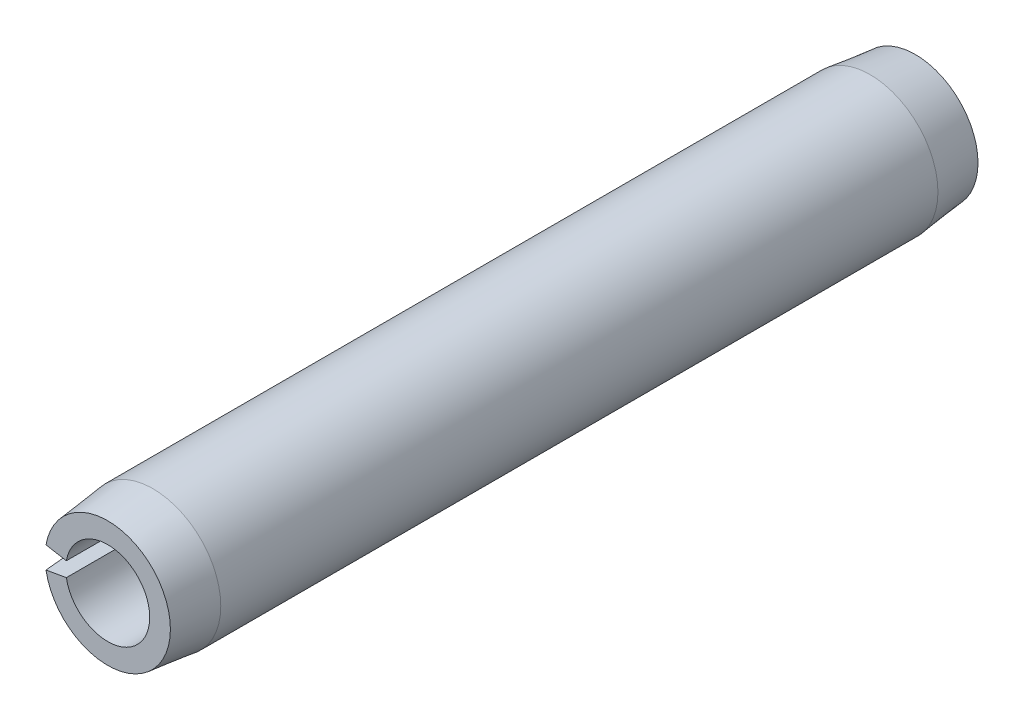
ISO-10303-21;
HEADER;
FILE_DESCRIPTION(('STEP AP214'),'2;1');
FILE_NAME('part.step','',(''),(''),'','','');
FILE_SCHEMA(('AUTOMOTIVE_DESIGN { 1 0 10303 214 1 1 1 1 }'));
ENDSEC;
DATA;
#1=APPLICATION_CONTEXT('core data for automotive mechanical design processes');
#2=APPLICATION_PROTOCOL_DEFINITION('international standard','automotive_design',2000,#1);
#3=PRODUCT_CONTEXT('',#1,'mechanical');
#4=PRODUCT('Part','Part','',(#3));
#5=PRODUCT_RELATED_PRODUCT_CATEGORY('part','',(#4));
#6=PRODUCT_DEFINITION_FORMATION('','',#4);
#7=PRODUCT_DEFINITION_CONTEXT('part definition',#1,'design');
#8=PRODUCT_DEFINITION('design','',#6,#7);
#9=PRODUCT_DEFINITION_SHAPE('','',#8);
#10=(LENGTH_UNIT() NAMED_UNIT(*) SI_UNIT(.MILLI.,.METRE.));
#11=(NAMED_UNIT(*) PLANE_ANGLE_UNIT() SI_UNIT($,.RADIAN.));
#12=(NAMED_UNIT(*) SI_UNIT($,.STERADIAN.) SOLID_ANGLE_UNIT());
#13=UNCERTAINTY_MEASURE_WITH_UNIT(LENGTH_MEASURE(1.E-05),#10,'distance_accuracy_value','');
#14=(GEOMETRIC_REPRESENTATION_CONTEXT(3) GLOBAL_UNCERTAINTY_ASSIGNED_CONTEXT((#13)) GLOBAL_UNIT_ASSIGNED_CONTEXT((#10,
#11,#12)) REPRESENTATION_CONTEXT('',''));
#15=CARTESIAN_POINT('',(0.,0.,0.));
#16=DIRECTION('',(0.,0.,1.));
#17=DIRECTION('',(1.,0.,0.));
#18=AXIS2_PLACEMENT_3D('',#15,#16,#17);
#19=CARTESIAN_POINT('',(0.,0.,4.7625));
#20=DIRECTION('',(0.,0.,1.));
#21=DIRECTION('',(1.,0.,0.));
#22=AXIS2_PLACEMENT_3D('',#19,#20,#21);
#23=PLANE('',#22);
#24=CARTESIAN_POINT('',(0.,0.,4.7625));
#25=DIRECTION('',(0.,0.,-1.));
#26=DIRECTION('',(-1.,0.,0.));
#27=AXIS2_PLACEMENT_3D('',#24,#25,#26);
#28=CIRCLE('',#27,0.739140000000003);
#29=CARTESIAN_POINT('',(-0.727910802561447,0.128350314040733,4.7625));
#30=VERTEX_POINT('',#29);
#31=CARTESIAN_POINT('',(-0.727910802561448,-0.128350314040733,4.7625));
#32=VERTEX_POINT('',#31);
#33=EDGE_CURVE('E121',#30,#32,#28,.T.);
#34=ORIENTED_EDGE('',*,*,#33,.F.);
#35=DIRECTION('',(0.984807753012209,-0.173648177666927,0.));
#36=VECTOR('',#35,1.);
#37=CARTESIAN_POINT('',(-0.787944683185068,0.138935906951308,4.7625));
#38=LINE('',#37,#36);
#39=CARTESIAN_POINT('',(-0.487775280066947,0.0860079423984288,4.7625));
#40=VERTEX_POINT('',#39);
#41=EDGE_CURVE('E142',#30,#40,#38,.T.);
#42=ORIENTED_EDGE('',*,*,#41,.T.);
#43=CARTESIAN_POINT('',(0.,0.,4.7625));
#44=DIRECTION('',(0.,0.,-1.));
#45=DIRECTION('',(1.,0.,0.));
#46=AXIS2_PLACEMENT_3D('',#43,#44,#45);
#47=CIRCLE('',#46,0.4953);
#48=CARTESIAN_POINT('',(-0.487775280066947,-0.0860079423984287,4.7625));
#49=VERTEX_POINT('',#48);
#50=EDGE_CURVE('E141',#40,#49,#47,.T.);
#51=ORIENTED_EDGE('',*,*,#50,.T.);
#52=DIRECTION('',(-0.984807753012209,-0.173648177666928,0.));
#53=VECTOR('',#52,1.);
#54=CARTESIAN_POINT('',(-0.487775280066947,-0.0860079423984287,4.7625));
#55=LINE('',#54,#53);
#56=EDGE_CURVE('E135',#49,#32,#55,.T.);
#57=ORIENTED_EDGE('',*,*,#56,.T.);
#58=EDGE_LOOP('',(#34,#42,#51,#57));
#59=FACE_BOUND('',#58,.T.);
#60=ADVANCED_FACE('F69',(#59),#23,.T.);
#61=CARTESIAN_POINT('',(0.,0.,-4.7625));
#62=DIRECTION('',(0.,0.,1.));
#63=DIRECTION('',(1.,0.,0.));
#64=AXIS2_PLACEMENT_3D('',#61,#62,#63);
#65=CYLINDRICAL_SURFACE('',#64,0.4953);
#66=DIRECTION('',(0.,0.,1.));
#67=VECTOR('',#66,1.);
#68=CARTESIAN_POINT('',(-0.487775280066947,-0.0860079423984287,-4.7625));
#69=LINE('',#68,#67);
#70=CARTESIAN_POINT('',(-0.487775280066947,-0.0860079423984287,-4.7625));
#71=VERTEX_POINT('',#70);
#72=EDGE_CURVE('E73',#71,#49,#69,.T.);
#73=ORIENTED_EDGE('',*,*,#72,.T.);
#74=ORIENTED_EDGE('',*,*,#50,.F.);
#75=DIRECTION('',(0.,0.,1.));
#76=VECTOR('',#75,1.);
#77=CARTESIAN_POINT('',(-0.487775280066947,0.0860079423984288,-4.7625));
#78=LINE('',#77,#76);
#79=CARTESIAN_POINT('',(-0.487775280066947,0.0860079423984288,-4.7625));
#80=VERTEX_POINT('',#79);
#81=EDGE_CURVE('E12',#80,#40,#78,.T.);
#82=ORIENTED_EDGE('',*,*,#81,.F.);
#83=CARTESIAN_POINT('',(0.,0.,-4.7625));
#84=DIRECTION('',(0.,0.,-1.));
#85=DIRECTION('',(1.,0.,0.));
#86=AXIS2_PLACEMENT_3D('',#83,#84,#85);
#87=CIRCLE('',#86,0.4953);
#88=EDGE_CURVE('E144',#80,#71,#87,.T.);
#89=ORIENTED_EDGE('',*,*,#88,.T.);
#90=EDGE_LOOP('',(#73,#74,#82,#89));
#91=FACE_BOUND('',#90,.T.);
#92=ADVANCED_FACE('F71',(#91),#65,.F.);
#93=CARTESIAN_POINT('',(-0.787944683185068,0.138935906951308,-4.7625));
#94=DIRECTION('',(-0.173648177666927,-0.984807753012209,0.));
#95=DIRECTION('',(0.984807753012209,-0.173648177666927,0.));
#96=AXIS2_PLACEMENT_3D('',#93,#94,#95);
#97=PLANE('',#96);
#98=DIRECTION('',(-0.111821563303197,0.0197171586353527,-0.993532672656404));
#99=VECTOR('',#98,1.);
#100=CARTESIAN_POINT('',(0.,0.,11.229975));
#101=LINE('',#100,#99);
#102=CARTESIAN_POINT('',(-0.787944683185071,0.138935906951309,4.2291));
#103=VERTEX_POINT('',#102);
#104=EDGE_CURVE('E86',#103,#30,#101,.F.);
#105=ORIENTED_EDGE('',*,*,#104,.F.);
#106=DIRECTION('',(0.,0.,1.));
#107=VECTOR('',#106,1.);
#108=CARTESIAN_POINT('',(-0.787944683185068,0.138935906951308,-4.7625));
#109=LINE('',#108,#107);
#110=CARTESIAN_POINT('',(-0.787944683185071,0.138935906951309,-4.2291));
#111=VERTEX_POINT('',#110);
#112=EDGE_CURVE('E78',#111,#103,#109,.T.);
#113=ORIENTED_EDGE('',*,*,#112,.F.);
#114=DIRECTION('',(0.111821563303197,-0.0197171586353527,-0.993532672656404));
#115=VECTOR('',#114,1.);
#116=CARTESIAN_POINT('',(0.,0.,-11.229975));
#117=LINE('',#116,#115);
#118=CARTESIAN_POINT('',(-0.727910802561447,0.128350314040733,-4.7625));
#119=VERTEX_POINT('',#118);
#120=EDGE_CURVE('E146',#119,#111,#117,.F.);
#121=ORIENTED_EDGE('',*,*,#120,.F.);
#122=DIRECTION('',(0.984807753012209,-0.173648177666927,0.));
#123=VECTOR('',#122,1.);
#124=CARTESIAN_POINT('',(-0.787944683185068,0.138935906951308,-4.7625));
#125=LINE('',#124,#123);
#126=EDGE_CURVE('E155',#119,#80,#125,.T.);
#127=ORIENTED_EDGE('',*,*,#126,.T.);
#128=ORIENTED_EDGE('',*,*,#81,.T.);
#129=ORIENTED_EDGE('',*,*,#41,.F.);
#130=EDGE_LOOP('',(#105,#113,#121,#127,#128,#129));
#131=FACE_BOUND('',#130,.T.);
#132=ADVANCED_FACE('F178',(#131),#97,.T.);
#133=CARTESIAN_POINT('',(0.,0.,-4.7625));
#134=DIRECTION('',(0.,0.,1.));
#135=DIRECTION('',(1.,0.,0.));
#136=AXIS2_PLACEMENT_3D('',#133,#134,#135);
#137=CYLINDRICAL_SURFACE('',#136,0.8001);
#138=CARTESIAN_POINT('',(0.,0.,4.2291));
#139=DIRECTION('',(0.,0.,-1.));
#140=DIRECTION('',(-1.,0.,0.));
#141=AXIS2_PLACEMENT_3D('',#138,#139,#140);
#142=CIRCLE('',#141,0.800100000000004);
#143=CARTESIAN_POINT('',(-0.787944683185072,-0.138935906951309,4.2291));
#144=VERTEX_POINT('',#143);
#145=EDGE_CURVE('E129',#103,#144,#142,.T.);
#146=ORIENTED_EDGE('',*,*,#145,.T.);
#147=DIRECTION('',(0.,0.,1.));
#148=VECTOR('',#147,1.);
#149=CARTESIAN_POINT('',(-0.787944683185068,-0.138935906951308,-4.7625));
#150=LINE('',#149,#148);
#151=CARTESIAN_POINT('',(-0.787944683185072,-0.138935906951309,-4.2291));
#152=VERTEX_POINT('',#151);
#153=EDGE_CURVE('E138',#152,#144,#150,.T.);
#154=ORIENTED_EDGE('',*,*,#153,.F.);
#155=CARTESIAN_POINT('',(0.,0.,-4.2291));
#156=DIRECTION('',(0.,0.,-1.));
#157=DIRECTION('',(-1.,0.,0.));
#158=AXIS2_PLACEMENT_3D('',#155,#156,#157);
#159=CIRCLE('',#158,0.800100000000004);
#160=EDGE_CURVE('E167',#111,#152,#159,.T.);
#161=ORIENTED_EDGE('',*,*,#160,.F.);
#162=ORIENTED_EDGE('',*,*,#112,.T.);
#163=EDGE_LOOP('',(#146,#154,#161,#162));
#164=FACE_BOUND('',#163,.T.);
#165=ADVANCED_FACE('F177',(#164),#137,.T.);
#166=CARTESIAN_POINT('',(-0.487775280066947,-0.0860079423984287,-4.7625));
#167=DIRECTION('',(-0.173648177666928,0.984807753012208,0.));
#168=DIRECTION('',(-0.984807753012209,-0.173648177666928,0.));
#169=AXIS2_PLACEMENT_3D('',#166,#167,#168);
#170=PLANE('',#169);
#171=DIRECTION('',(0.111821563303197,0.0197171586353528,0.993532672656404));
#172=VECTOR('',#171,1.);
#173=CARTESIAN_POINT('',(0.,0.,11.229975));
#174=LINE('',#173,#172);
#175=EDGE_CURVE('E124',#32,#144,#174,.F.);
#176=ORIENTED_EDGE('',*,*,#175,.F.);
#177=ORIENTED_EDGE('',*,*,#56,.F.);
#178=ORIENTED_EDGE('',*,*,#72,.F.);
#179=DIRECTION('',(-0.984807753012209,-0.173648177666928,0.));
#180=VECTOR('',#179,1.);
#181=CARTESIAN_POINT('',(-0.487775280066947,-0.0860079423984287,-4.7625));
#182=LINE('',#181,#180);
#183=CARTESIAN_POINT('',(-0.727910802561448,-0.128350314040733,-4.7625));
#184=VERTEX_POINT('',#183);
#185=EDGE_CURVE('E152',#71,#184,#182,.T.);
#186=ORIENTED_EDGE('',*,*,#185,.T.);
#187=DIRECTION('',(-0.111821563303197,-0.0197171586353528,0.993532672656404));
#188=VECTOR('',#187,1.);
#189=CARTESIAN_POINT('',(0.,0.,-11.229975));
#190=LINE('',#189,#188);
#191=EDGE_CURVE('E94',#152,#184,#190,.F.);
#192=ORIENTED_EDGE('',*,*,#191,.F.);
#193=ORIENTED_EDGE('',*,*,#153,.T.);
#194=EDGE_LOOP('',(#176,#177,#178,#186,#192,#193));
#195=FACE_BOUND('',#194,.T.);
#196=ADVANCED_FACE('F134',(#195),#170,.T.);
#197=CARTESIAN_POINT('',(0.,0.,-4.7625));
#198=DIRECTION('',(0.,0.,1.));
#199=DIRECTION('',(1.,0.,0.));
#200=AXIS2_PLACEMENT_3D('',#197,#198,#199);
#201=PLANE('',#200);
#202=ORIENTED_EDGE('',*,*,#126,.F.);
#203=CARTESIAN_POINT('',(0.,0.,-4.7625));
#204=DIRECTION('',(0.,0.,-1.));
#205=DIRECTION('',(-1.,0.,0.));
#206=AXIS2_PLACEMENT_3D('',#203,#204,#205);
#207=CIRCLE('',#206,0.739140000000003);
#208=EDGE_CURVE('E165',#119,#184,#207,.T.);
#209=ORIENTED_EDGE('',*,*,#208,.T.);
#210=ORIENTED_EDGE('',*,*,#185,.F.);
#211=ORIENTED_EDGE('',*,*,#88,.F.);
#212=EDGE_LOOP('',(#202,#209,#210,#211));
#213=FACE_BOUND('',#212,.T.);
#214=ADVANCED_FACE('F164',(#213),#201,.F.);
#215=CARTESIAN_POINT('',(0.,0.,-4.2291));
#216=DIRECTION('',(0.,0.,1.));
#217=DIRECTION('',(1.,0.,0.));
#218=AXIS2_PLACEMENT_3D('',#215,#216,#217);
#219=CONICAL_SURFACE('',#218,0.800100000000004,0.113792007143708);
#220=ORIENTED_EDGE('',*,*,#120,.T.);
#221=ORIENTED_EDGE('',*,*,#160,.T.);
#222=ORIENTED_EDGE('',*,*,#191,.T.);
#223=ORIENTED_EDGE('',*,*,#208,.F.);
#224=EDGE_LOOP('',(#220,#221,#222,#223));
#225=FACE_BOUND('',#224,.T.);
#226=ADVANCED_FACE('F173',(#225),#219,.T.);
#227=CARTESIAN_POINT('',(0.,0.,4.2291));
#228=DIRECTION('',(0.,0.,-1.));
#229=DIRECTION('',(1.,0.,0.));
#230=AXIS2_PLACEMENT_3D('',#227,#228,#229);
#231=CONICAL_SURFACE('',#230,0.800100000000004,0.113792007143708);
#232=ORIENTED_EDGE('',*,*,#104,.T.);
#233=ORIENTED_EDGE('',*,*,#33,.T.);
#234=ORIENTED_EDGE('',*,*,#175,.T.);
#235=ORIENTED_EDGE('',*,*,#145,.F.);
#236=EDGE_LOOP('',(#232,#233,#234,#235));
#237=FACE_BOUND('',#236,.T.);
#238=ADVANCED_FACE('F123',(#237),#231,.T.);
#239=CLOSED_SHELL('',(#60,#92,#132,#165,#196,#214,#226,#238));
#240=MANIFOLD_SOLID_BREP('B2',#239);
#241=ADVANCED_BREP_SHAPE_REPRESENTATION('',(#18,#240),#14);
#242=SHAPE_DEFINITION_REPRESENTATION(#9,#241);
ENDSEC;
END-ISO-10303-21;
